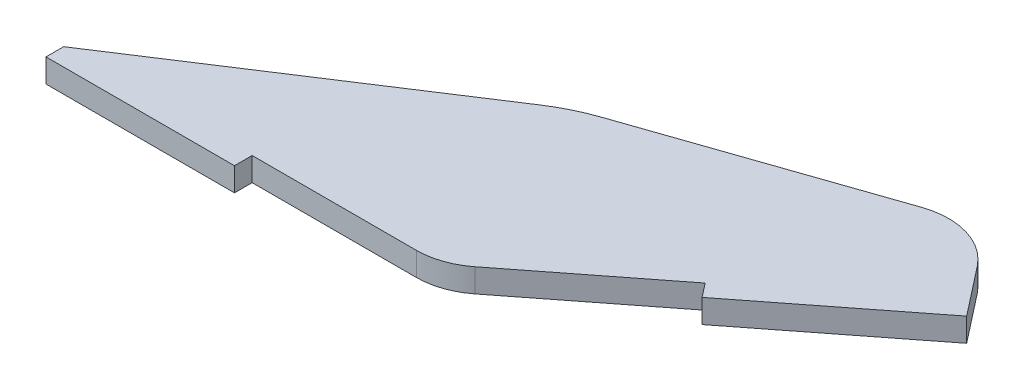
ISO-10303-21;
HEADER;
FILE_DESCRIPTION(('STEP AP214'),'2;1');
FILE_NAME('part.step','',(''),(''),'','','');
FILE_SCHEMA(('AUTOMOTIVE_DESIGN { 1 0 10303 214 1 1 1 1 }'));
ENDSEC;
DATA;
#1=APPLICATION_CONTEXT('core data for automotive mechanical design processes');
#2=APPLICATION_PROTOCOL_DEFINITION('international standard','automotive_design',2000,#1);
#3=PRODUCT_CONTEXT('',#1,'mechanical');
#4=PRODUCT('Part','Part','',(#3));
#5=PRODUCT_RELATED_PRODUCT_CATEGORY('part','',(#4));
#6=PRODUCT_DEFINITION_FORMATION('','',#4);
#7=PRODUCT_DEFINITION_CONTEXT('part definition',#1,'design');
#8=PRODUCT_DEFINITION('design','',#6,#7);
#9=PRODUCT_DEFINITION_SHAPE('','',#8);
#10=(LENGTH_UNIT() NAMED_UNIT(*) SI_UNIT(.MILLI.,.METRE.));
#11=(NAMED_UNIT(*) PLANE_ANGLE_UNIT() SI_UNIT($,.RADIAN.));
#12=(NAMED_UNIT(*) SI_UNIT($,.STERADIAN.) SOLID_ANGLE_UNIT());
#13=UNCERTAINTY_MEASURE_WITH_UNIT(LENGTH_MEASURE(1.E-05),#10,'distance_accuracy_value','');
#14=(GEOMETRIC_REPRESENTATION_CONTEXT(3) GLOBAL_UNCERTAINTY_ASSIGNED_CONTEXT((#13)) GLOBAL_UNIT_ASSIGNED_CONTEXT((#10,
#11,#12)) REPRESENTATION_CONTEXT('',''));
#15=CARTESIAN_POINT('',(0.,0.,0.));
#16=DIRECTION('',(0.,0.,1.));
#17=DIRECTION('',(1.,0.,0.));
#18=AXIS2_PLACEMENT_3D('',#15,#16,#17);
#19=CARTESIAN_POINT('',(-50.8,3.175,0.));
#20=DIRECTION('',(0.,0.,-1.));
#21=DIRECTION('',(-1.,0.,0.));
#22=AXIS2_PLACEMENT_3D('',#19,#20,#21);
#23=PLANE('',#22);
#24=DIRECTION('',(1.,0.,0.));
#25=VECTOR('',#24,1.);
#26=CARTESIAN_POINT('',(-50.8,0.,0.));
#27=LINE('',#26,#25);
#28=CARTESIAN_POINT('',(-25.4,0.,0.));
#29=VERTEX_POINT('',#28);
#30=CARTESIAN_POINT('',(-3.27972051658407,0.,0.));
#31=VERTEX_POINT('',#30);
#32=EDGE_CURVE('E160',#29,#31,#27,.T.);
#33=ORIENTED_EDGE('',*,*,#32,.T.);
#34=DIRECTION('',(0.,-1.,0.));
#35=VECTOR('',#34,1.);
#36=CARTESIAN_POINT('',(-3.27972051658407,3.175,0.));
#37=LINE('',#36,#35);
#38=CARTESIAN_POINT('',(-3.27972051658407,3.175,0.));
#39=VERTEX_POINT('',#38);
#40=EDGE_CURVE('E235',#31,#39,#37,.F.);
#41=ORIENTED_EDGE('',*,*,#40,.T.);
#42=DIRECTION('',(1.,0.,0.));
#43=VECTOR('',#42,1.);
#44=CARTESIAN_POINT('',(-50.8,3.175,0.));
#45=LINE('',#44,#43);
#46=CARTESIAN_POINT('',(-25.4,3.175,0.));
#47=VERTEX_POINT('',#46);
#48=EDGE_CURVE('E143',#47,#39,#45,.T.);
#49=ORIENTED_EDGE('',*,*,#48,.F.);
#50=DIRECTION('',(0.,1.,0.));
#51=VECTOR('',#50,1.);
#52=CARTESIAN_POINT('',(-25.4,-27.7165041055107,0.));
#53=LINE('',#52,#51);
#54=EDGE_CURVE('E163',#29,#47,#53,.T.);
#55=ORIENTED_EDGE('',*,*,#54,.F.);
#56=EDGE_LOOP('',(#33,#41,#49,#55));
#57=FACE_BOUND('',#56,.T.);
#58=ADVANCED_FACE('F33',(#57),#23,.F.);
#59=CARTESIAN_POINT('',(-50.8,3.175,0.));
#60=DIRECTION('',(1.,0.,0.));
#61=DIRECTION('',(0.,0.,-1.));
#62=AXIS2_PLACEMENT_3D('',#59,#60,#61);
#63=PLANE('',#62);
#64=DIRECTION('',(0.,0.,1.));
#65=VECTOR('',#64,1.);
#66=CARTESIAN_POINT('',(-50.8,3.175,0.));
#67=LINE('',#66,#65);
#68=CARTESIAN_POINT('',(-50.8,3.175,0.));
#69=VERTEX_POINT('',#68);
#70=CARTESIAN_POINT('',(-50.8,3.175,2.38125));
#71=VERTEX_POINT('',#70);
#72=EDGE_CURVE('E136',#69,#71,#67,.T.);
#73=ORIENTED_EDGE('',*,*,#72,.F.);
#74=DIRECTION('',(0.,1.,0.));
#75=VECTOR('',#74,1.);
#76=CARTESIAN_POINT('',(-50.8,-5.00000000001367E-05,0.));
#77=LINE('',#76,#75);
#78=CARTESIAN_POINT('',(-50.8,0.,0.));
#79=VERTEX_POINT('',#78);
#80=EDGE_CURVE('E125',#79,#69,#77,.T.);
#81=ORIENTED_EDGE('',*,*,#80,.F.);
#82=DIRECTION('',(0.,0.,1.));
#83=VECTOR('',#82,1.);
#84=CARTESIAN_POINT('',(-50.8,0.,0.));
#85=LINE('',#84,#83);
#86=CARTESIAN_POINT('',(-50.8,0.,2.38125));
#87=VERTEX_POINT('',#86);
#88=EDGE_CURVE('E221',#79,#87,#85,.T.);
#89=ORIENTED_EDGE('',*,*,#88,.T.);
#90=DIRECTION('',(0.,1.,0.));
#91=VECTOR('',#90,1.);
#92=CARTESIAN_POINT('',(-50.8,-27.7165041055107,2.38125));
#93=LINE('',#92,#91);
#94=EDGE_CURVE('E141',#87,#71,#93,.T.);
#95=ORIENTED_EDGE('',*,*,#94,.T.);
#96=EDGE_LOOP('',(#73,#81,#89,#95));
#97=FACE_BOUND('',#96,.T.);
#98=ADVANCED_FACE('F139',(#97),#63,.F.);
#99=CARTESIAN_POINT('',(0.,3.175,0.));
#100=DIRECTION('',(-0.61566147532566,0.,-0.788010753606721));
#101=DIRECTION('',(-0.788010753606721,0.,0.61566147532566));
#102=AXIS2_PLACEMENT_3D('',#99,#100,#101);
#103=PLANE('',#102);
#104=DIRECTION('',(0.788010753606721,0.,-0.61566147532566));
#105=VECTOR('',#104,1.);
#106=CARTESIAN_POINT('',(0.,3.175,0.));
#107=LINE('',#106,#105);
#108=CARTESIAN_POINT('',(2.58445503589284,3.175,-2.01919757189598));
#109=VERTEX_POINT('',#108);
#110=CARTESIAN_POINT('',(20.0154731416107,3.175,-15.6378014732718));
#111=VERTEX_POINT('',#110);
#112=EDGE_CURVE('E147',#109,#111,#107,.T.);
#113=ORIENTED_EDGE('',*,*,#112,.F.);
#114=DIRECTION('',(0.,-1.,0.));
#115=VECTOR('',#114,1.);
#116=CARTESIAN_POINT('',(2.58445503589284,3.175,-2.01919757189598));
#117=LINE('',#116,#115);
#118=CARTESIAN_POINT('',(2.58445503589284,0.,-2.01919757189598));
#119=VERTEX_POINT('',#118);
#120=EDGE_CURVE('E236',#109,#119,#117,.T.);
#121=ORIENTED_EDGE('',*,*,#120,.T.);
#122=DIRECTION('',(0.788010753606721,0.,-0.61566147532566));
#123=VECTOR('',#122,1.);
#124=CARTESIAN_POINT('',(0.,0.,0.));
#125=LINE('',#124,#123);
#126=CARTESIAN_POINT('',(20.0154731416107,0.,-15.6378014732718));
#127=VERTEX_POINT('',#126);
#128=EDGE_CURVE('E224',#119,#127,#125,.T.);
#129=ORIENTED_EDGE('',*,*,#128,.T.);
#130=DIRECTION('',(0.,1.,0.));
#131=VECTOR('',#130,1.);
#132=CARTESIAN_POINT('',(20.0154731416107,-27.7165041055107,-15.6378014732717));
#133=LINE('',#132,#131);
#134=EDGE_CURVE('E191',#127,#111,#133,.T.);
#135=ORIENTED_EDGE('',*,*,#134,.T.);
#136=EDGE_LOOP('',(#113,#121,#129,#135));
#137=FACE_BOUND('',#136,.T.);
#138=ADVANCED_FACE('F267',(#137),#103,.F.);
#139=CARTESIAN_POINT('',(32.2120455465855,3.175,-41.2833395173489));
#140=DIRECTION('',(-0.788010753606721,0.,0.615661475325659));
#141=DIRECTION('',(0.615661475325659,0.,0.788010753606721));
#142=AXIS2_PLACEMENT_3D('',#139,#140,#141);
#143=PLANE('',#142);
#144=DIRECTION('',(-0.615661475325659,0.,-0.788010753606721));
#145=VECTOR('',#144,1.);
#146=CARTESIAN_POINT('',(32.2120455465855,0.,-41.2833395173489));
#147=LINE('',#146,#145);
#148=CARTESIAN_POINT('',(41.4969901713406,0.,-29.3991523395175));
#149=VERTEX_POINT('',#148);
#150=CARTESIAN_POINT('',(36.3949213170984,0.,-35.9295026763778));
#151=VERTEX_POINT('',#150);
#152=EDGE_CURVE('E150',#149,#151,#147,.T.);
#153=ORIENTED_EDGE('',*,*,#152,.T.);
#154=DIRECTION('',(0.,-1.,0.));
#155=VECTOR('',#154,1.);
#156=CARTESIAN_POINT('',(36.3949213170984,3.175,-35.9295026763778));
#157=LINE('',#156,#155);
#158=CARTESIAN_POINT('',(36.3949213170984,3.175,-35.9295026763778));
#159=VERTEX_POINT('',#158);
#160=EDGE_CURVE('E216',#151,#159,#157,.F.);
#161=ORIENTED_EDGE('',*,*,#160,.T.);
#162=DIRECTION('',(-0.615661475325659,0.,-0.788010753606721));
#163=VECTOR('',#162,1.);
#164=CARTESIAN_POINT('',(32.2120455465855,3.175,-41.2833395173489));
#165=LINE('',#164,#163);
#166=CARTESIAN_POINT('',(41.4969901713406,3.175,-29.3991523395175));
#167=VERTEX_POINT('',#166);
#168=EDGE_CURVE('E205',#167,#159,#165,.T.);
#169=ORIENTED_EDGE('',*,*,#168,.F.);
#170=DIRECTION('',(0.,1.,0.));
#171=VECTOR('',#170,1.);
#172=CARTESIAN_POINT('',(41.4969901713406,-27.7165041055107,-29.3991523395175));
#173=LINE('',#172,#171);
#174=EDGE_CURVE('E188',#149,#167,#173,.T.);
#175=ORIENTED_EDGE('',*,*,#174,.F.);
#176=EDGE_LOOP('',(#153,#161,#169,#175));
#177=FACE_BOUND('',#176,.T.);
#178=ADVANCED_FACE('F214',(#177),#143,.F.);
#179=CARTESIAN_POINT('',(-50.8,3.175,-12.7));
#180=DIRECTION('',(0.325568154457157,0.,0.945518575599317));
#181=DIRECTION('',(0.945518575599317,0.,-0.325568154457157));
#182=AXIS2_PLACEMENT_3D('',#179,#180,#181);
#183=PLANE('',#182);
#184=DIRECTION('',(-0.945518575599317,0.,0.325568154457157));
#185=VECTOR('',#184,1.);
#186=CARTESIAN_POINT('',(-50.8,0.,-12.7));
#187=LINE('',#186,#185);
#188=CARTESIAN_POINT('',(25.78808221779,0.,-39.0713915564843));
#189=VERTEX_POINT('',#188);
#190=CARTESIAN_POINT('',(-6.3374513698375,0.,-28.0096832505996));
#191=VERTEX_POINT('',#190);
#192=EDGE_CURVE('E144',#189,#191,#187,.T.);
#193=ORIENTED_EDGE('',*,*,#192,.T.);
#194=DIRECTION('',(0.,1.,0.));
#195=VECTOR('',#194,1.);
#196=CARTESIAN_POINT('',(-6.33745136983751,3.175,-28.0096832505996));
#197=LINE('',#196,#195);
#198=CARTESIAN_POINT('',(-6.3374513698375,3.175,-28.0096832505996));
#199=VERTEX_POINT('',#198);
#200=EDGE_CURVE('E231',#191,#199,#197,.T.);
#201=ORIENTED_EDGE('',*,*,#200,.T.);
#202=DIRECTION('',(-0.945518575599317,0.,0.325568154457157));
#203=VECTOR('',#202,1.);
#204=CARTESIAN_POINT('',(-50.8,3.175,-12.7));
#205=LINE('',#204,#203);
#206=CARTESIAN_POINT('',(25.78808221779,3.175,-39.0713915564843));
#207=VERTEX_POINT('',#206);
#208=EDGE_CURVE('E217',#207,#199,#205,.T.);
#209=ORIENTED_EDGE('',*,*,#208,.F.);
#210=DIRECTION('',(0.,-1.,0.));
#211=VECTOR('',#210,1.);
#212=CARTESIAN_POINT('',(25.78808221779,3.175,-39.0713915564843));
#213=LINE('',#212,#211);
#214=EDGE_CURVE('E248',#207,#189,#213,.T.);
#215=ORIENTED_EDGE('',*,*,#214,.T.);
#216=EDGE_LOOP('',(#193,#201,#209,#215));
#217=FACE_BOUND('',#216,.T.);
#218=ADVANCED_FACE('F277',(#217),#183,.F.);
#219=CARTESIAN_POINT('',(0.,3.175,0.));
#220=DIRECTION('',(0.,-1.,0.));
#221=DIRECTION('',(0.,0.,-1.));
#222=AXIS2_PLACEMENT_3D('',#219,#220,#221);
#223=PLANE('',#222);
#224=ORIENTED_EDGE('',*,*,#208,.T.);
#225=CARTESIAN_POINT('',(1.93197975337429,3.175,-3.99351143037692));
#226=DIRECTION('',(0.,-1.,0.));
#227=DIRECTION('',(0.,0.,-1.));
#228=AXIS2_PLACEMENT_3D('',#225,#226,#227);
#229=CIRCLE('',#228,25.4);
#230=CARTESIAN_POINT('',(-11.9153240746757,3.175,-25.2869887578045));
#231=VERTEX_POINT('',#230);
#232=EDGE_CURVE('E55',#199,#231,#229,.F.);
#233=ORIENTED_EDGE('',*,*,#232,.T.);
#234=DIRECTION('',(0.838325879032582,0.,-0.545169442049212));
#235=VECTOR('',#234,1.);
#236=CARTESIAN_POINT('',(-50.8,3.175,0.));
#237=LINE('',#236,#235);
#238=EDGE_CURVE('E127',#69,#231,#237,.T.);
#239=ORIENTED_EDGE('',*,*,#238,.F.);
#240=ORIENTED_EDGE('',*,*,#72,.T.);
#241=DIRECTION('',(1.,0.,0.));
#242=VECTOR('',#241,1.);
#243=CARTESIAN_POINT('',(-50.8,3.175,2.38125));
#244=LINE('',#243,#242);
#245=CARTESIAN_POINT('',(-25.4,3.175,2.38125));
#246=VERTEX_POINT('',#245);
#247=EDGE_CURVE('E183',#71,#246,#244,.T.);
#248=ORIENTED_EDGE('',*,*,#247,.T.);
#249=DIRECTION('',(0.,0.,-1.));
#250=VECTOR('',#249,1.);
#251=CARTESIAN_POINT('',(-25.4,3.175,0.));
#252=LINE('',#251,#250);
#253=EDGE_CURVE('E168',#246,#47,#252,.T.);
#254=ORIENTED_EDGE('',*,*,#253,.T.);
#255=ORIENTED_EDGE('',*,*,#48,.T.);
#256=CARTESIAN_POINT('',(-3.27972051658407,3.175,-9.525));
#257=DIRECTION('',(0.,-1.,0.));
#258=DIRECTION('',(0.,0.,-1.));
#259=AXIS2_PLACEMENT_3D('',#256,#257,#258);
#260=CIRCLE('',#259,9.525);
#261=EDGE_CURVE('E246',#39,#109,#260,.F.);
#262=ORIENTED_EDGE('',*,*,#261,.T.);
#263=ORIENTED_EDGE('',*,*,#112,.T.);
#264=DIRECTION('',(0.615661475325659,0.,0.788010753606722));
#265=VECTOR('',#264,1.);
#266=CARTESIAN_POINT('',(21.4815170297299,3.175,-13.7613508662457));
#267=LINE('',#266,#265);
#268=CARTESIAN_POINT('',(21.4815170297299,3.175,-13.7613508662457));
#269=VERTEX_POINT('',#268);
#270=EDGE_CURVE('E132',#111,#269,#267,.T.);
#271=ORIENTED_EDGE('',*,*,#270,.T.);
#272=DIRECTION('',(0.788010753606721,0.,-0.61566147532566));
#273=VECTOR('',#272,1.);
#274=CARTESIAN_POINT('',(41.4969901713406,3.175,-29.3991523395175));
#275=LINE('',#274,#273);
#276=EDGE_CURVE('E199',#269,#167,#275,.T.);
#277=ORIENTED_EDGE('',*,*,#276,.T.);
#278=ORIENTED_EDGE('',*,*,#168,.T.);
#279=CARTESIAN_POINT('',(28.8891188889944,3.175,-30.0653271239008));
#280=DIRECTION('',(0.,-1.,0.));
#281=DIRECTION('',(0.,0.,-1.));
#282=AXIS2_PLACEMENT_3D('',#279,#280,#281);
#283=CIRCLE('',#282,9.525);
#284=EDGE_CURVE('E244',#159,#207,#283,.F.);
#285=ORIENTED_EDGE('',*,*,#284,.T.);
#286=EDGE_LOOP('',(#224,#233,#239,#240,#248,#254,#255,#262,#263,#271,#277,#278,#285));
#287=FACE_BOUND('',#286,.T.);
#288=ADVANCED_FACE('F134',(#287),#223,.F.);
#289=CARTESIAN_POINT('',(0.,0.,0.));
#290=DIRECTION('',(0.,-1.,0.));
#291=DIRECTION('',(0.,0.,-1.));
#292=AXIS2_PLACEMENT_3D('',#289,#290,#291);
#293=PLANE('',#292);
#294=DIRECTION('',(-0.838325879032582,0.,0.545169442049212));
#295=VECTOR('',#294,1.);
#296=CARTESIAN_POINT('',(-15.0982538036478,0.,-23.2171063077625));
#297=LINE('',#296,#295);
#298=CARTESIAN_POINT('',(-11.9153240746757,0.,-25.2869887578045));
#299=VERTEX_POINT('',#298);
#300=EDGE_CURVE('E128',#299,#79,#297,.T.);
#301=ORIENTED_EDGE('',*,*,#300,.F.);
#302=CARTESIAN_POINT('',(1.93197975337429,0.,-3.99351143037692));
#303=DIRECTION('',(0.,-1.,0.));
#304=DIRECTION('',(0.,0.,-1.));
#305=AXIS2_PLACEMENT_3D('',#302,#303,#304);
#306=CIRCLE('',#305,25.4);
#307=EDGE_CURVE('E11',#299,#191,#306,.T.);
#308=ORIENTED_EDGE('',*,*,#307,.T.);
#309=ORIENTED_EDGE('',*,*,#192,.F.);
#310=CARTESIAN_POINT('',(28.8891188889944,0.,-30.0653271239008));
#311=DIRECTION('',(0.,-1.,0.));
#312=DIRECTION('',(0.,0.,-1.));
#313=AXIS2_PLACEMENT_3D('',#310,#311,#312);
#314=CIRCLE('',#313,9.525);
#315=EDGE_CURVE('E251',#189,#151,#314,.T.);
#316=ORIENTED_EDGE('',*,*,#315,.T.);
#317=ORIENTED_EDGE('',*,*,#152,.F.);
#318=DIRECTION('',(0.788010753606721,0.,-0.61566147532566));
#319=VECTOR('',#318,1.);
#320=CARTESIAN_POINT('',(41.4969901713406,0.,-29.3991523395175));
#321=LINE('',#320,#319);
#322=CARTESIAN_POINT('',(21.4815170297299,0.,-13.7613508662457));
#323=VERTEX_POINT('',#322);
#324=EDGE_CURVE('E192',#323,#149,#321,.T.);
#325=ORIENTED_EDGE('',*,*,#324,.F.);
#326=DIRECTION('',(0.615661475325659,0.,0.788010753606722));
#327=VECTOR('',#326,1.);
#328=CARTESIAN_POINT('',(21.4815170297299,0.,-13.7613508662457));
#329=LINE('',#328,#327);
#330=EDGE_CURVE('E185',#127,#323,#329,.T.);
#331=ORIENTED_EDGE('',*,*,#330,.F.);
#332=ORIENTED_EDGE('',*,*,#128,.F.);
#333=CARTESIAN_POINT('',(-3.27972051658407,0.,-9.525));
#334=DIRECTION('',(0.,-1.,0.));
#335=DIRECTION('',(0.,0.,-1.));
#336=AXIS2_PLACEMENT_3D('',#333,#334,#335);
#337=CIRCLE('',#336,9.525);
#338=EDGE_CURVE('E218',#119,#31,#337,.T.);
#339=ORIENTED_EDGE('',*,*,#338,.T.);
#340=ORIENTED_EDGE('',*,*,#32,.F.);
#341=DIRECTION('',(0.,0.,-1.));
#342=VECTOR('',#341,1.);
#343=CARTESIAN_POINT('',(-25.4,0.,0.));
#344=LINE('',#343,#342);
#345=CARTESIAN_POINT('',(-25.4,0.,2.38125));
#346=VERTEX_POINT('',#345);
#347=EDGE_CURVE('E167',#346,#29,#344,.T.);
#348=ORIENTED_EDGE('',*,*,#347,.F.);
#349=DIRECTION('',(1.,0.,0.));
#350=VECTOR('',#349,1.);
#351=CARTESIAN_POINT('',(-50.8,0.,2.38125));
#352=LINE('',#351,#350);
#353=EDGE_CURVE('E172',#87,#346,#352,.T.);
#354=ORIENTED_EDGE('',*,*,#353,.F.);
#355=ORIENTED_EDGE('',*,*,#88,.F.);
#356=EDGE_LOOP('',(#301,#308,#309,#316,#317,#325,#331,#332,#339,#340,#348,#354,#355));
#357=FACE_BOUND('',#356,.T.);
#358=ADVANCED_FACE('F259',(#357),#293,.T.);
#359=CARTESIAN_POINT('',(-50.8,-27.7165041055107,2.38125));
#360=DIRECTION('',(0.,0.,1.));
#361=DIRECTION('',(1.,0.,0.));
#362=AXIS2_PLACEMENT_3D('',#359,#360,#361);
#363=PLANE('',#362);
#364=ORIENTED_EDGE('',*,*,#94,.F.);
#365=ORIENTED_EDGE('',*,*,#353,.T.);
#366=DIRECTION('',(0.,1.,0.));
#367=VECTOR('',#366,1.);
#368=CARTESIAN_POINT('',(-25.4,-27.7165041055107,2.38125));
#369=LINE('',#368,#367);
#370=EDGE_CURVE('E174',#346,#246,#369,.T.);
#371=ORIENTED_EDGE('',*,*,#370,.T.);
#372=ORIENTED_EDGE('',*,*,#247,.F.);
#373=EDGE_LOOP('',(#364,#365,#371,#372));
#374=FACE_BOUND('',#373,.T.);
#375=ADVANCED_FACE('F281',(#374),#363,.T.);
#376=CARTESIAN_POINT('',(-25.4,-27.7165041055107,0.));
#377=DIRECTION('',(1.,0.,0.));
#378=DIRECTION('',(0.,0.,-1.));
#379=AXIS2_PLACEMENT_3D('',#376,#377,#378);
#380=PLANE('',#379);
#381=ORIENTED_EDGE('',*,*,#370,.F.);
#382=ORIENTED_EDGE('',*,*,#347,.T.);
#383=ORIENTED_EDGE('',*,*,#54,.T.);
#384=ORIENTED_EDGE('',*,*,#253,.F.);
#385=EDGE_LOOP('',(#381,#382,#383,#384));
#386=FACE_BOUND('',#385,.T.);
#387=ADVANCED_FACE('F283',(#386),#380,.T.);
#388=CARTESIAN_POINT('',(41.4969901713406,-27.7165041055107,-29.3991523395175));
#389=DIRECTION('',(0.61566147532566,0.,0.788010753606721));
#390=DIRECTION('',(0.788010753606721,0.,-0.61566147532566));
#391=AXIS2_PLACEMENT_3D('',#388,#389,#390);
#392=PLANE('',#391);
#393=DIRECTION('',(0.,1.,0.));
#394=VECTOR('',#393,1.);
#395=CARTESIAN_POINT('',(21.4815170297299,-27.7165041055107,-13.7613508662457));
#396=LINE('',#395,#394);
#397=EDGE_CURVE('E184',#323,#269,#396,.T.);
#398=ORIENTED_EDGE('',*,*,#397,.F.);
#399=ORIENTED_EDGE('',*,*,#324,.T.);
#400=ORIENTED_EDGE('',*,*,#174,.T.);
#401=ORIENTED_EDGE('',*,*,#276,.F.);
#402=EDGE_LOOP('',(#398,#399,#400,#401));
#403=FACE_BOUND('',#402,.T.);
#404=ADVANCED_FACE('F210',(#403),#392,.T.);
#405=CARTESIAN_POINT('',(21.4815170297299,-27.7165041055107,-13.7613508662457));
#406=DIRECTION('',(-0.788010753606722,0.,0.615661475325659));
#407=DIRECTION('',(0.615661475325659,0.,0.788010753606722));
#408=AXIS2_PLACEMENT_3D('',#405,#406,#407);
#409=PLANE('',#408);
#410=ORIENTED_EDGE('',*,*,#134,.F.);
#411=ORIENTED_EDGE('',*,*,#330,.T.);
#412=ORIENTED_EDGE('',*,*,#397,.T.);
#413=ORIENTED_EDGE('',*,*,#270,.F.);
#414=EDGE_LOOP('',(#410,#411,#412,#413));
#415=FACE_BOUND('',#414,.T.);
#416=ADVANCED_FACE('F270',(#415),#409,.T.);
#417=CARTESIAN_POINT('',(28.8891188889944,3.175,-30.0653271239008));
#418=DIRECTION('',(0.,-1.,0.));
#419=DIRECTION('',(0.,0.,-1.));
#420=AXIS2_PLACEMENT_3D('',#417,#418,#419);
#421=CYLINDRICAL_SURFACE('',#420,9.525);
#422=ORIENTED_EDGE('',*,*,#284,.F.);
#423=ORIENTED_EDGE('',*,*,#160,.F.);
#424=ORIENTED_EDGE('',*,*,#315,.F.);
#425=ORIENTED_EDGE('',*,*,#214,.F.);
#426=EDGE_LOOP('',(#422,#423,#424,#425));
#427=FACE_BOUND('',#426,.T.);
#428=ADVANCED_FACE('F274',(#427),#421,.T.);
#429=CARTESIAN_POINT('',(-3.27972051658407,3.175,-9.525));
#430=DIRECTION('',(0.,-1.,0.));
#431=DIRECTION('',(0.,0.,-1.));
#432=AXIS2_PLACEMENT_3D('',#429,#430,#431);
#433=CYLINDRICAL_SURFACE('',#432,9.525);
#434=ORIENTED_EDGE('',*,*,#261,.F.);
#435=ORIENTED_EDGE('',*,*,#40,.F.);
#436=ORIENTED_EDGE('',*,*,#338,.F.);
#437=ORIENTED_EDGE('',*,*,#120,.F.);
#438=EDGE_LOOP('',(#434,#435,#436,#437));
#439=FACE_BOUND('',#438,.T.);
#440=ADVANCED_FACE('F264',(#439),#433,.T.);
#441=CARTESIAN_POINT('',(-50.8,-5.00000000001367E-05,0.));
#442=DIRECTION('',(0.545169442049212,0.,0.838325879032582));
#443=DIRECTION('',(0.838325879032582,0.,-0.545169442049212));
#444=AXIS2_PLACEMENT_3D('',#441,#442,#443);
#445=PLANE('',#444);
#446=ORIENTED_EDGE('',*,*,#238,.T.);
#447=DIRECTION('',(0.,1.,0.));
#448=VECTOR('',#447,1.);
#449=CARTESIAN_POINT('',(-11.9153240746757,-5.00000000001367E-05,-25.2869887578045));
#450=LINE('',#449,#448);
#451=EDGE_CURVE('E41',#231,#299,#450,.F.);
#452=ORIENTED_EDGE('',*,*,#451,.T.);
#453=ORIENTED_EDGE('',*,*,#300,.T.);
#454=ORIENTED_EDGE('',*,*,#80,.T.);
#455=EDGE_LOOP('',(#446,#452,#453,#454));
#456=FACE_BOUND('',#455,.T.);
#457=ADVANCED_FACE('F126',(#456),#445,.F.);
#458=CARTESIAN_POINT('',(1.93197975337429,3.175,-3.99351143037692));
#459=DIRECTION('',(0.,1.,0.));
#460=DIRECTION('',(0.,0.,1.));
#461=AXIS2_PLACEMENT_3D('',#458,#459,#460);
#462=CYLINDRICAL_SURFACE('',#461,25.4);
#463=ORIENTED_EDGE('',*,*,#307,.F.);
#464=ORIENTED_EDGE('',*,*,#451,.F.);
#465=ORIENTED_EDGE('',*,*,#232,.F.);
#466=ORIENTED_EDGE('',*,*,#200,.F.);
#467=EDGE_LOOP('',(#463,#464,#465,#466));
#468=FACE_BOUND('',#467,.T.);
#469=ADVANCED_FACE('F35',(#468),#462,.T.);
#470=CLOSED_SHELL('',(#58,#98,#138,#178,#218,#288,#358,#375,#387,#404,#416,#428,#440,#457,#469));
#471=MANIFOLD_SOLID_BREP('B2',#470);
#472=ADVANCED_BREP_SHAPE_REPRESENTATION('',(#18,#471),#14);
#473=SHAPE_DEFINITION_REPRESENTATION(#9,#472);
ENDSEC;
END-ISO-10303-21;
